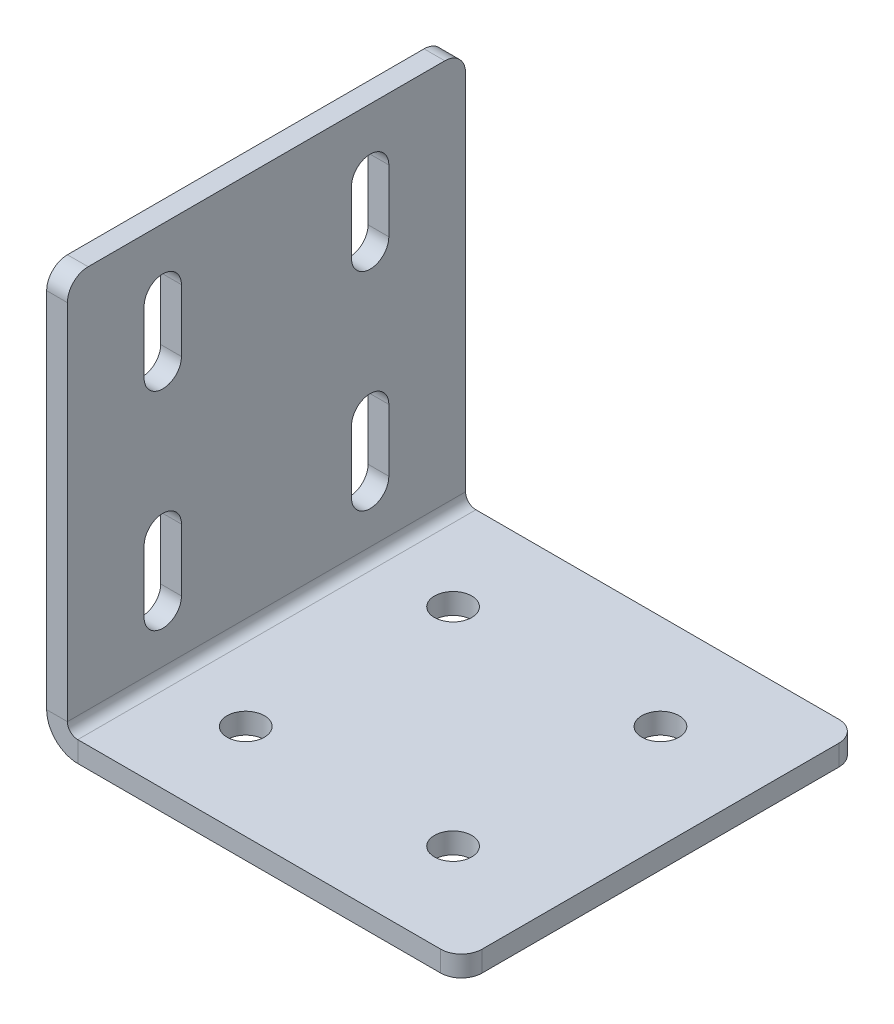
ISO-10303-21;
HEADER;
FILE_DESCRIPTION(('STEP AP214'),'2;1');
FILE_NAME('part.step','',(''),(''),'','','');
FILE_SCHEMA(('AUTOMOTIVE_DESIGN { 1 0 10303 214 1 1 1 1 }'));
ENDSEC;
DATA;
#1=APPLICATION_CONTEXT('core data for automotive mechanical design processes');
#2=APPLICATION_PROTOCOL_DEFINITION('international standard','automotive_design',2000,#1);
#3=PRODUCT_CONTEXT('',#1,'mechanical');
#4=PRODUCT('Part','Part','',(#3));
#5=PRODUCT_RELATED_PRODUCT_CATEGORY('part','',(#4));
#6=PRODUCT_DEFINITION_FORMATION('','',#4);
#7=PRODUCT_DEFINITION_CONTEXT('part definition',#1,'design');
#8=PRODUCT_DEFINITION('design','',#6,#7);
#9=PRODUCT_DEFINITION_SHAPE('','',#8);
#10=(LENGTH_UNIT() NAMED_UNIT(*) SI_UNIT(.MILLI.,.METRE.));
#11=(NAMED_UNIT(*) PLANE_ANGLE_UNIT() SI_UNIT($,.RADIAN.));
#12=(NAMED_UNIT(*) SI_UNIT($,.STERADIAN.) SOLID_ANGLE_UNIT());
#13=UNCERTAINTY_MEASURE_WITH_UNIT(LENGTH_MEASURE(1.E-05),#10,'distance_accuracy_value','');
#14=(GEOMETRIC_REPRESENTATION_CONTEXT(3) GLOBAL_UNCERTAINTY_ASSIGNED_CONTEXT((#13)) GLOBAL_UNIT_ASSIGNED_CONTEXT((#10,
#11,#12)) REPRESENTATION_CONTEXT('',''));
#15=CARTESIAN_POINT('',(0.,0.,0.));
#16=DIRECTION('',(0.,0.,1.));
#17=DIRECTION('',(1.,0.,0.));
#18=AXIS2_PLACEMENT_3D('',#15,#16,#17);
#19=CARTESIAN_POINT('',(0.,70.,-25.));
#20=DIRECTION('',(-1.,0.,0.));
#21=DIRECTION('',(0.,0.,1.));
#22=AXIS2_PLACEMENT_3D('',#19,#20,#21);
#23=CYLINDRICAL_SURFACE('',#22,4.5);
#24=CARTESIAN_POINT('',(4.99999999999999,70.,-25.));
#25=DIRECTION('',(1.,0.,0.));
#26=DIRECTION('',(0.,0.,-1.));
#27=AXIS2_PLACEMENT_3D('',#24,#25,#26);
#28=CIRCLE('',#27,4.5);
#29=CARTESIAN_POINT('',(5.,70.,-20.5));
#30=VERTEX_POINT('',#29);
#31=CARTESIAN_POINT('',(5.,70.,-29.5));
#32=VERTEX_POINT('',#31);
#33=EDGE_CURVE('E500',#30,#32,#28,.T.);
#34=ORIENTED_EDGE('',*,*,#33,.T.);
#35=DIRECTION('',(1.,0.,0.));
#36=VECTOR('',#35,1.);
#37=CARTESIAN_POINT('',(0.,70.,-29.5));
#38=LINE('',#37,#36);
#39=CARTESIAN_POINT('',(0.,70.,-29.5));
#40=VERTEX_POINT('',#39);
#41=EDGE_CURVE('E279',#40,#32,#38,.T.);
#42=ORIENTED_EDGE('',*,*,#41,.F.);
#43=CARTESIAN_POINT('',(0.,70.,-25.));
#44=DIRECTION('',(1.,0.,0.));
#45=DIRECTION('',(0.,0.,-1.));
#46=AXIS2_PLACEMENT_3D('',#43,#44,#45);
#47=CIRCLE('',#46,4.5);
#48=CARTESIAN_POINT('',(0.,70.,-20.5));
#49=VERTEX_POINT('',#48);
#50=EDGE_CURVE('E389',#49,#40,#47,.T.);
#51=ORIENTED_EDGE('',*,*,#50,.F.);
#52=DIRECTION('',(1.,0.,0.));
#53=VECTOR('',#52,1.);
#54=CARTESIAN_POINT('',(0.,70.,-20.5));
#55=LINE('',#54,#53);
#56=EDGE_CURVE('E246',#49,#30,#55,.T.);
#57=ORIENTED_EDGE('',*,*,#56,.T.);
#58=EDGE_LOOP('',(#34,#42,#51,#57));
#59=FACE_BOUND('',#58,.T.);
#60=ADVANCED_FACE('F49',(#59),#23,.F.);
#61=CARTESIAN_POINT('',(0.,20.,25.));
#62=DIRECTION('',(-1.,0.,0.));
#63=DIRECTION('',(0.,0.,1.));
#64=AXIS2_PLACEMENT_3D('',#61,#62,#63);
#65=CYLINDRICAL_SURFACE('',#64,4.5);
#66=CARTESIAN_POINT('',(5.,20.,25.));
#67=DIRECTION('',(1.,0.,0.));
#68=DIRECTION('',(0.,0.,-1.));
#69=AXIS2_PLACEMENT_3D('',#66,#67,#68);
#70=CIRCLE('',#69,4.5);
#71=CARTESIAN_POINT('',(5.,20.,29.5));
#72=VERTEX_POINT('',#71);
#73=CARTESIAN_POINT('',(5.,20.,20.5));
#74=VERTEX_POINT('',#73);
#75=EDGE_CURVE('E517',#72,#74,#70,.T.);
#76=ORIENTED_EDGE('',*,*,#75,.T.);
#77=DIRECTION('',(1.,0.,0.));
#78=VECTOR('',#77,1.);
#79=CARTESIAN_POINT('',(0.,20.,20.5));
#80=LINE('',#79,#78);
#81=CARTESIAN_POINT('',(0.,20.,20.5));
#82=VERTEX_POINT('',#81);
#83=EDGE_CURVE('E379',#82,#74,#80,.T.);
#84=ORIENTED_EDGE('',*,*,#83,.F.);
#85=CARTESIAN_POINT('',(0.,20.,25.));
#86=DIRECTION('',(1.,0.,0.));
#87=DIRECTION('',(0.,0.,-1.));
#88=AXIS2_PLACEMENT_3D('',#85,#86,#87);
#89=CIRCLE('',#88,4.5);
#90=CARTESIAN_POINT('',(0.,20.,29.5));
#91=VERTEX_POINT('',#90);
#92=EDGE_CURVE('E392',#91,#82,#89,.T.);
#93=ORIENTED_EDGE('',*,*,#92,.F.);
#94=DIRECTION('',(1.,0.,0.));
#95=VECTOR('',#94,1.);
#96=CARTESIAN_POINT('',(0.,20.,29.5));
#97=LINE('',#96,#95);
#98=EDGE_CURVE('E382',#91,#72,#97,.T.);
#99=ORIENTED_EDGE('',*,*,#98,.T.);
#100=EDGE_LOOP('',(#76,#84,#93,#99));
#101=FACE_BOUND('',#100,.T.);
#102=ADVANCED_FACE('F664',(#101),#65,.F.);
#103=CARTESIAN_POINT('',(0.,70.,25.));
#104=DIRECTION('',(-1.,0.,0.));
#105=DIRECTION('',(0.,0.,1.));
#106=AXIS2_PLACEMENT_3D('',#103,#104,#105);
#107=CYLINDRICAL_SURFACE('',#106,4.5);
#108=CARTESIAN_POINT('',(4.99999999999999,70.,25.));
#109=DIRECTION('',(1.,0.,0.));
#110=DIRECTION('',(0.,0.,-1.));
#111=AXIS2_PLACEMENT_3D('',#108,#109,#110);
#112=CIRCLE('',#111,4.5);
#113=CARTESIAN_POINT('',(5.,70.,29.5));
#114=VERTEX_POINT('',#113);
#115=CARTESIAN_POINT('',(5.,70.,20.5));
#116=VERTEX_POINT('',#115);
#117=EDGE_CURVE('E521',#114,#116,#112,.T.);
#118=ORIENTED_EDGE('',*,*,#117,.T.);
#119=DIRECTION('',(1.,0.,0.));
#120=VECTOR('',#119,1.);
#121=CARTESIAN_POINT('',(0.,70.,20.5));
#122=LINE('',#121,#120);
#123=CARTESIAN_POINT('',(0.,70.,20.5));
#124=VERTEX_POINT('',#123);
#125=EDGE_CURVE('E311',#124,#116,#122,.T.);
#126=ORIENTED_EDGE('',*,*,#125,.F.);
#127=CARTESIAN_POINT('',(0.,70.,25.));
#128=DIRECTION('',(1.,0.,0.));
#129=DIRECTION('',(0.,0.,-1.));
#130=AXIS2_PLACEMENT_3D('',#127,#128,#129);
#131=CIRCLE('',#130,4.5);
#132=CARTESIAN_POINT('',(0.,70.,29.5));
#133=VERTEX_POINT('',#132);
#134=EDGE_CURVE('E397',#133,#124,#131,.T.);
#135=ORIENTED_EDGE('',*,*,#134,.F.);
#136=DIRECTION('',(1.,0.,0.));
#137=VECTOR('',#136,1.);
#138=CARTESIAN_POINT('',(0.,70.,29.5));
#139=LINE('',#138,#137);
#140=EDGE_CURVE('E314',#133,#114,#139,.T.);
#141=ORIENTED_EDGE('',*,*,#140,.T.);
#142=EDGE_LOOP('',(#118,#126,#135,#141));
#143=FACE_BOUND('',#142,.T.);
#144=ADVANCED_FACE('F670',(#143),#107,.F.);
#145=CARTESIAN_POINT('',(0.,20.,-25.));
#146=DIRECTION('',(-1.,0.,0.));
#147=DIRECTION('',(0.,0.,1.));
#148=AXIS2_PLACEMENT_3D('',#145,#146,#147);
#149=CYLINDRICAL_SURFACE('',#148,4.5);
#150=CARTESIAN_POINT('',(5.,20.,-25.));
#151=DIRECTION('',(1.,0.,0.));
#152=DIRECTION('',(0.,0.,-1.));
#153=AXIS2_PLACEMENT_3D('',#150,#151,#152);
#154=CIRCLE('',#153,4.5);
#155=CARTESIAN_POINT('',(5.,20.,-20.5));
#156=VERTEX_POINT('',#155);
#157=CARTESIAN_POINT('',(5.,20.,-29.5));
#158=VERTEX_POINT('',#157);
#159=EDGE_CURVE('E510',#156,#158,#154,.T.);
#160=ORIENTED_EDGE('',*,*,#159,.T.);
#161=DIRECTION('',(1.,0.,0.));
#162=VECTOR('',#161,1.);
#163=CARTESIAN_POINT('',(0.,20.,-29.5));
#164=LINE('',#163,#162);
#165=CARTESIAN_POINT('',(0.,20.,-29.5));
#166=VERTEX_POINT('',#165);
#167=EDGE_CURVE('E344',#166,#158,#164,.T.);
#168=ORIENTED_EDGE('',*,*,#167,.F.);
#169=CARTESIAN_POINT('',(0.,20.,-25.));
#170=DIRECTION('',(1.,0.,0.));
#171=DIRECTION('',(0.,0.,-1.));
#172=AXIS2_PLACEMENT_3D('',#169,#170,#171);
#173=CIRCLE('',#172,4.5);
#174=CARTESIAN_POINT('',(0.,20.,-20.5));
#175=VERTEX_POINT('',#174);
#176=EDGE_CURVE('E401',#175,#166,#173,.T.);
#177=ORIENTED_EDGE('',*,*,#176,.F.);
#178=DIRECTION('',(1.,0.,0.));
#179=VECTOR('',#178,1.);
#180=CARTESIAN_POINT('',(0.,20.,-20.5));
#181=LINE('',#180,#179);
#182=EDGE_CURVE('E347',#175,#156,#181,.T.);
#183=ORIENTED_EDGE('',*,*,#182,.T.);
#184=EDGE_LOOP('',(#160,#168,#177,#183));
#185=FACE_BOUND('',#184,.T.);
#186=ADVANCED_FACE('F678',(#185),#149,.F.);
#187=CARTESIAN_POINT('',(0.,0.,48.));
#188=DIRECTION('',(0.,0.,-1.));
#189=DIRECTION('',(0.,-1.,0.));
#190=AXIS2_PLACEMENT_3D('',#187,#188,#189);
#191=PLANE('',#190);
#192=DIRECTION('',(0.,1.,0.));
#193=VECTOR('',#192,1.);
#194=CARTESIAN_POINT('',(5.,0.,48.));
#195=LINE('',#194,#193);
#196=CARTESIAN_POINT('',(5.,95.,48.));
#197=VERTEX_POINT('',#196);
#198=CARTESIAN_POINT('',(5.,7.5,48.));
#199=VERTEX_POINT('',#198);
#200=EDGE_CURVE('E507',#197,#199,#195,.F.);
#201=ORIENTED_EDGE('',*,*,#200,.F.);
#202=DIRECTION('',(1.,0.,0.));
#203=VECTOR('',#202,1.);
#204=CARTESIAN_POINT('',(0.,95.,48.));
#205=LINE('',#204,#203);
#206=CARTESIAN_POINT('',(0.,95.,48.));
#207=VERTEX_POINT('',#206);
#208=EDGE_CURVE('E11',#197,#207,#205,.F.);
#209=ORIENTED_EDGE('',*,*,#208,.T.);
#210=DIRECTION('',(0.,-1.,0.));
#211=VECTOR('',#210,1.);
#212=CARTESIAN_POINT('',(0.,0.,48.));
#213=LINE('',#212,#211);
#214=CARTESIAN_POINT('',(0.,7.5,48.));
#215=VERTEX_POINT('',#214);
#216=EDGE_CURVE('E405',#207,#215,#213,.T.);
#217=ORIENTED_EDGE('',*,*,#216,.T.);
#218=DIRECTION('',(-1.,0.,0.));
#219=VECTOR('',#218,1.);
#220=CARTESIAN_POINT('',(0.,7.5,48.));
#221=LINE('',#220,#219);
#222=EDGE_CURVE('E535',#199,#215,#221,.T.);
#223=ORIENTED_EDGE('',*,*,#222,.F.);
#224=EDGE_LOOP('',(#201,#209,#217,#223));
#225=FACE_BOUND('',#224,.T.);
#226=ADVANCED_FACE('F621',(#225),#191,.F.);
#227=CARTESIAN_POINT('',(0.,100.,-48.));
#228=DIRECTION('',(0.,-1.,0.));
#229=DIRECTION('',(0.,0.,1.));
#230=AXIS2_PLACEMENT_3D('',#227,#228,#229);
#231=PLANE('',#230);
#232=DIRECTION('',(0.,0.,1.));
#233=VECTOR('',#232,1.);
#234=CARTESIAN_POINT('',(5.,100.,-48.));
#235=LINE('',#234,#233);
#236=CARTESIAN_POINT('',(5.,100.,-43.));
#237=VERTEX_POINT('',#236);
#238=CARTESIAN_POINT('',(5.,100.,43.));
#239=VERTEX_POINT('',#238);
#240=EDGE_CURVE('E503',#237,#239,#235,.T.);
#241=ORIENTED_EDGE('',*,*,#240,.F.);
#242=DIRECTION('',(-1.,0.,0.));
#243=VECTOR('',#242,1.);
#244=CARTESIAN_POINT('',(0.,100.,-43.));
#245=LINE('',#244,#243);
#246=CARTESIAN_POINT('',(0.,100.,-43.));
#247=VERTEX_POINT('',#246);
#248=EDGE_CURVE('E570',#237,#247,#245,.T.);
#249=ORIENTED_EDGE('',*,*,#248,.T.);
#250=DIRECTION('',(0.,0.,1.));
#251=VECTOR('',#250,1.);
#252=CARTESIAN_POINT('',(0.,100.,-48.));
#253=LINE('',#252,#251);
#254=CARTESIAN_POINT('',(0.,100.,43.));
#255=VERTEX_POINT('',#254);
#256=EDGE_CURVE('E408',#247,#255,#253,.T.);
#257=ORIENTED_EDGE('',*,*,#256,.T.);
#258=DIRECTION('',(1.,0.,0.));
#259=VECTOR('',#258,1.);
#260=CARTESIAN_POINT('',(0.,100.,43.));
#261=LINE('',#260,#259);
#262=EDGE_CURVE('E567',#255,#239,#261,.T.);
#263=ORIENTED_EDGE('',*,*,#262,.T.);
#264=EDGE_LOOP('',(#241,#249,#257,#263));
#265=FACE_BOUND('',#264,.T.);
#266=ADVANCED_FACE('F599',(#265),#231,.F.);
#267=CARTESIAN_POINT('',(0.,0.,-48.));
#268=DIRECTION('',(0.,0.,-1.));
#269=DIRECTION('',(0.,-1.,0.));
#270=AXIS2_PLACEMENT_3D('',#267,#268,#269);
#271=PLANE('',#270);
#272=DIRECTION('',(0.,-1.,0.));
#273=VECTOR('',#272,1.);
#274=CARTESIAN_POINT('',(0.,0.,-48.));
#275=LINE('',#274,#273);
#276=CARTESIAN_POINT('',(0.,95.,-48.));
#277=VERTEX_POINT('',#276);
#278=CARTESIAN_POINT('',(0.,7.5,-48.));
#279=VERTEX_POINT('',#278);
#280=EDGE_CURVE('E412',#277,#279,#275,.T.);
#281=ORIENTED_EDGE('',*,*,#280,.F.);
#282=DIRECTION('',(1.,0.,0.));
#283=VECTOR('',#282,1.);
#284=CARTESIAN_POINT('',(0.,95.,-48.));
#285=LINE('',#284,#283);
#286=CARTESIAN_POINT('',(5.,95.,-48.));
#287=VERTEX_POINT('',#286);
#288=EDGE_CURVE('E580',#277,#287,#285,.T.);
#289=ORIENTED_EDGE('',*,*,#288,.T.);
#290=DIRECTION('',(0.,1.,0.));
#291=VECTOR('',#290,1.);
#292=CARTESIAN_POINT('',(5.,0.,-48.));
#293=LINE('',#292,#291);
#294=CARTESIAN_POINT('',(5.,7.5,-48.));
#295=VERTEX_POINT('',#294);
#296=EDGE_CURVE('E473',#287,#295,#293,.F.);
#297=ORIENTED_EDGE('',*,*,#296,.T.);
#298=DIRECTION('',(-1.,0.,0.));
#299=VECTOR('',#298,1.);
#300=CARTESIAN_POINT('',(0.,7.5,-48.));
#301=LINE('',#300,#299);
#302=EDGE_CURVE('E531',#295,#279,#301,.T.);
#303=ORIENTED_EDGE('',*,*,#302,.T.);
#304=EDGE_LOOP('',(#281,#289,#297,#303));
#305=FACE_BOUND('',#304,.T.);
#306=ADVANCED_FACE('F606',(#305),#271,.T.);
#307=CARTESIAN_POINT('',(7.5,7.5,-48.));
#308=DIRECTION('',(0.,0.,1.));
#309=DIRECTION('',(1.,0.,0.));
#310=AXIS2_PLACEMENT_3D('',#307,#308,#309);
#311=PLANE('',#310);
#312=ORIENTED_EDGE('',*,*,#302,.F.);
#313=CARTESIAN_POINT('',(7.5,7.5,-48.));
#314=DIRECTION('',(0.,0.,1.));
#315=DIRECTION('',(1.,0.,0.));
#316=AXIS2_PLACEMENT_3D('',#313,#314,#315);
#317=CIRCLE('',#316,2.5);
#318=CARTESIAN_POINT('',(7.5,5.,-48.));
#319=VERTEX_POINT('',#318);
#320=EDGE_CURVE('E496',#295,#319,#317,.T.);
#321=ORIENTED_EDGE('',*,*,#320,.T.);
#322=DIRECTION('',(0.,-1.,0.));
#323=VECTOR('',#322,1.);
#324=CARTESIAN_POINT('',(7.50000000000001,0.,-48.));
#325=LINE('',#324,#323);
#326=CARTESIAN_POINT('',(7.50000000000001,0.,-48.));
#327=VERTEX_POINT('',#326);
#328=EDGE_CURVE('E528',#319,#327,#325,.T.);
#329=ORIENTED_EDGE('',*,*,#328,.T.);
#330=CARTESIAN_POINT('',(7.5,7.5,-48.));
#331=DIRECTION('',(0.,0.,-1.));
#332=DIRECTION('',(-1.,0.,0.));
#333=AXIS2_PLACEMENT_3D('',#330,#331,#332);
#334=CIRCLE('',#333,7.5);
#335=EDGE_CURVE('E393',#279,#327,#334,.F.);
#336=ORIENTED_EDGE('',*,*,#335,.F.);
#337=EDGE_LOOP('',(#312,#321,#329,#336));
#338=FACE_BOUND('',#337,.T.);
#339=ADVANCED_FACE('F611',(#338),#311,.F.);
#340=CARTESIAN_POINT('',(100.,0.,-48.));
#341=DIRECTION('',(0.,0.,-1.));
#342=DIRECTION('',(1.,0.,0.));
#343=AXIS2_PLACEMENT_3D('',#340,#341,#342);
#344=PLANE('',#343);
#345=DIRECTION('',(1.,0.,0.));
#346=VECTOR('',#345,1.);
#347=CARTESIAN_POINT('',(100.,5.,-48.));
#348=LINE('',#347,#346);
#349=CARTESIAN_POINT('',(95.,5.,-48.));
#350=VERTEX_POINT('',#349);
#351=EDGE_CURVE('E467',#319,#350,#348,.T.);
#352=ORIENTED_EDGE('',*,*,#351,.T.);
#353=DIRECTION('',(0.,-1.,0.));
#354=VECTOR('',#353,1.);
#355=CARTESIAN_POINT('',(95.,0.,-48.));
#356=LINE('',#355,#354);
#357=CARTESIAN_POINT('',(95.,0.,-48.));
#358=VERTEX_POINT('',#357);
#359=EDGE_CURVE('E539',#350,#358,#356,.T.);
#360=ORIENTED_EDGE('',*,*,#359,.T.);
#361=DIRECTION('',(1.,0.,0.));
#362=VECTOR('',#361,1.);
#363=CARTESIAN_POINT('',(100.,0.,-48.));
#364=LINE('',#363,#362);
#365=EDGE_CURVE('E439',#327,#358,#364,.T.);
#366=ORIENTED_EDGE('',*,*,#365,.F.);
#367=ORIENTED_EDGE('',*,*,#328,.F.);
#368=EDGE_LOOP('',(#352,#360,#366,#367));
#369=FACE_BOUND('',#368,.T.);
#370=ADVANCED_FACE('F654',(#369),#344,.T.);
#371=CARTESIAN_POINT('',(100.,0.,-48.));
#372=DIRECTION('',(1.,0.,0.));
#373=DIRECTION('',(0.,0.,1.));
#374=AXIS2_PLACEMENT_3D('',#371,#372,#373);
#375=PLANE('',#374);
#376=DIRECTION('',(0.,0.,1.));
#377=VECTOR('',#376,1.);
#378=CARTESIAN_POINT('',(100.,0.,-48.));
#379=LINE('',#378,#377);
#380=CARTESIAN_POINT('',(100.,0.,-43.));
#381=VERTEX_POINT('',#380);
#382=CARTESIAN_POINT('',(100.,0.,43.));
#383=VERTEX_POINT('',#382);
#384=EDGE_CURVE('E431',#381,#383,#379,.T.);
#385=ORIENTED_EDGE('',*,*,#384,.F.);
#386=DIRECTION('',(0.,-1.,0.));
#387=VECTOR('',#386,1.);
#388=CARTESIAN_POINT('',(100.,0.,-43.));
#389=LINE('',#388,#387);
#390=CARTESIAN_POINT('',(100.,5.,-43.));
#391=VERTEX_POINT('',#390);
#392=EDGE_CURVE('E555',#381,#391,#389,.F.);
#393=ORIENTED_EDGE('',*,*,#392,.T.);
#394=DIRECTION('',(0.,0.,1.));
#395=VECTOR('',#394,1.);
#396=CARTESIAN_POINT('',(100.,5.,-48.));
#397=LINE('',#396,#395);
#398=CARTESIAN_POINT('',(100.,5.,43.));
#399=VERTEX_POINT('',#398);
#400=EDGE_CURVE('E485',#391,#399,#397,.T.);
#401=ORIENTED_EDGE('',*,*,#400,.T.);
#402=DIRECTION('',(0.,1.,0.));
#403=VECTOR('',#402,1.);
#404=CARTESIAN_POINT('',(100.,0.,43.));
#405=LINE('',#404,#403);
#406=EDGE_CURVE('E551',#399,#383,#405,.F.);
#407=ORIENTED_EDGE('',*,*,#406,.T.);
#408=EDGE_LOOP('',(#385,#393,#401,#407));
#409=FACE_BOUND('',#408,.T.);
#410=ADVANCED_FACE('F645',(#409),#375,.T.);
#411=CARTESIAN_POINT('',(100.,0.,48.));
#412=DIRECTION('',(0.,0.,-1.));
#413=DIRECTION('',(1.,0.,0.));
#414=AXIS2_PLACEMENT_3D('',#411,#412,#413);
#415=PLANE('',#414);
#416=DIRECTION('',(1.,0.,0.));
#417=VECTOR('',#416,1.);
#418=CARTESIAN_POINT('',(100.,0.,48.));
#419=LINE('',#418,#417);
#420=CARTESIAN_POINT('',(7.50000000000001,0.,48.));
#421=VERTEX_POINT('',#420);
#422=CARTESIAN_POINT('',(95.,0.,48.));
#423=VERTEX_POINT('',#422);
#424=EDGE_CURVE('E435',#421,#423,#419,.T.);
#425=ORIENTED_EDGE('',*,*,#424,.T.);
#426=DIRECTION('',(0.,-1.,0.));
#427=VECTOR('',#426,1.);
#428=CARTESIAN_POINT('',(95.,0.,48.));
#429=LINE('',#428,#427);
#430=CARTESIAN_POINT('',(95.,5.,48.));
#431=VERTEX_POINT('',#430);
#432=EDGE_CURVE('E564',#423,#431,#429,.F.);
#433=ORIENTED_EDGE('',*,*,#432,.T.);
#434=DIRECTION('',(1.,0.,0.));
#435=VECTOR('',#434,1.);
#436=CARTESIAN_POINT('',(100.,5.,48.));
#437=LINE('',#436,#435);
#438=CARTESIAN_POINT('',(7.50000000000001,5.,48.));
#439=VERTEX_POINT('',#438);
#440=EDGE_CURVE('E486',#439,#431,#437,.T.);
#441=ORIENTED_EDGE('',*,*,#440,.F.);
#442=DIRECTION('',(0.,-1.,0.));
#443=VECTOR('',#442,1.);
#444=CARTESIAN_POINT('',(7.50000000000001,0.,48.));
#445=LINE('',#444,#443);
#446=EDGE_CURVE('E451',#439,#421,#445,.T.);
#447=ORIENTED_EDGE('',*,*,#446,.T.);
#448=EDGE_LOOP('',(#425,#433,#441,#447));
#449=FACE_BOUND('',#448,.T.);
#450=ADVANCED_FACE('F632',(#449),#415,.F.);
#451=CARTESIAN_POINT('',(25.,0.,-25.));
#452=DIRECTION('',(0.,-1.,0.));
#453=DIRECTION('',(1.,0.,0.));
#454=AXIS2_PLACEMENT_3D('',#451,#452,#453);
#455=CYLINDRICAL_SURFACE('',#454,4.49999999999999);
#456=CARTESIAN_POINT('',(25.,0.,-25.));
#457=DIRECTION('',(0.,-1.,0.));
#458=DIRECTION('',(0.,0.,-1.));
#459=AXIS2_PLACEMENT_3D('',#456,#457,#458);
#460=CIRCLE('',#459,4.49999999999999);
#461=CARTESIAN_POINT('',(25.,0.,-29.5));
#462=VERTEX_POINT('',#461);
#463=EDGE_CURVE('E415',#462,#462,#460,.T.);
#464=ORIENTED_EDGE('',*,*,#463,.T.);
#465=EDGE_LOOP('',(#464));
#466=FACE_BOUND('',#465,.T.);
#467=CARTESIAN_POINT('',(25.,5.,-25.));
#468=DIRECTION('',(0.,-1.,0.));
#469=DIRECTION('',(0.,0.,-1.));
#470=AXIS2_PLACEMENT_3D('',#467,#468,#469);
#471=CIRCLE('',#470,4.49999999999999);
#472=CARTESIAN_POINT('',(25.,5.,-29.5));
#473=VERTEX_POINT('',#472);
#474=EDGE_CURVE('E468',#473,#473,#471,.T.);
#475=ORIENTED_EDGE('',*,*,#474,.F.);
#476=EDGE_LOOP('',(#475));
#477=FACE_BOUND('',#476,.T.);
#478=ADVANCED_FACE('F722',(#466,#477),#455,.F.);
#479=CARTESIAN_POINT('',(75.,0.,25.));
#480=DIRECTION('',(0.,-1.,0.));
#481=DIRECTION('',(1.,0.,0.));
#482=AXIS2_PLACEMENT_3D('',#479,#480,#481);
#483=CYLINDRICAL_SURFACE('',#482,4.49999999999999);
#484=CARTESIAN_POINT('',(75.,0.,25.));
#485=DIRECTION('',(0.,-1.,0.));
#486=DIRECTION('',(0.,0.,-1.));
#487=AXIS2_PLACEMENT_3D('',#484,#485,#486);
#488=CIRCLE('',#487,4.49999999999999);
#489=CARTESIAN_POINT('',(75.,0.,20.5));
#490=VERTEX_POINT('',#489);
#491=EDGE_CURVE('E419',#490,#490,#488,.T.);
#492=ORIENTED_EDGE('',*,*,#491,.T.);
#493=EDGE_LOOP('',(#492));
#494=FACE_BOUND('',#493,.T.);
#495=CARTESIAN_POINT('',(75.,5.,25.));
#496=DIRECTION('',(0.,-1.,0.));
#497=DIRECTION('',(0.,0.,-1.));
#498=AXIS2_PLACEMENT_3D('',#495,#496,#497);
#499=CIRCLE('',#498,4.49999999999999);
#500=CARTESIAN_POINT('',(75.,5.,20.5));
#501=VERTEX_POINT('',#500);
#502=EDGE_CURVE('E472',#501,#501,#499,.T.);
#503=ORIENTED_EDGE('',*,*,#502,.F.);
#504=EDGE_LOOP('',(#503));
#505=FACE_BOUND('',#504,.T.);
#506=ADVANCED_FACE('F725',(#494,#505),#483,.F.);
#507=CARTESIAN_POINT('',(75.,0.,-25.));
#508=DIRECTION('',(0.,-1.,0.));
#509=DIRECTION('',(1.,0.,0.));
#510=AXIS2_PLACEMENT_3D('',#507,#508,#509);
#511=CYLINDRICAL_SURFACE('',#510,4.49999999999999);
#512=CARTESIAN_POINT('',(75.,0.,-25.));
#513=DIRECTION('',(0.,-1.,0.));
#514=DIRECTION('',(0.,0.,-1.));
#515=AXIS2_PLACEMENT_3D('',#512,#513,#514);
#516=CIRCLE('',#515,4.49999999999999);
#517=CARTESIAN_POINT('',(75.,0.,-29.5));
#518=VERTEX_POINT('',#517);
#519=EDGE_CURVE('E423',#518,#518,#516,.T.);
#520=ORIENTED_EDGE('',*,*,#519,.T.);
#521=EDGE_LOOP('',(#520));
#522=FACE_BOUND('',#521,.T.);
#523=CARTESIAN_POINT('',(75.,5.,-25.));
#524=DIRECTION('',(0.,-1.,0.));
#525=DIRECTION('',(0.,0.,-1.));
#526=AXIS2_PLACEMENT_3D('',#523,#524,#525);
#527=CIRCLE('',#526,4.49999999999999);
#528=CARTESIAN_POINT('',(75.,5.,-29.5));
#529=VERTEX_POINT('',#528);
#530=EDGE_CURVE('E477',#529,#529,#527,.T.);
#531=ORIENTED_EDGE('',*,*,#530,.F.);
#532=EDGE_LOOP('',(#531));
#533=FACE_BOUND('',#532,.T.);
#534=ADVANCED_FACE('F729',(#522,#533),#511,.F.);
#535=CARTESIAN_POINT('',(25.,0.,25.));
#536=DIRECTION('',(0.,-1.,0.));
#537=DIRECTION('',(1.,0.,0.));
#538=AXIS2_PLACEMENT_3D('',#535,#536,#537);
#539=CYLINDRICAL_SURFACE('',#538,4.49999999999999);
#540=CARTESIAN_POINT('',(25.,0.,25.));
#541=DIRECTION('',(0.,-1.,0.));
#542=DIRECTION('',(0.,0.,-1.));
#543=AXIS2_PLACEMENT_3D('',#540,#541,#542);
#544=CIRCLE('',#543,4.49999999999999);
#545=CARTESIAN_POINT('',(25.,0.,20.5));
#546=VERTEX_POINT('',#545);
#547=EDGE_CURVE('E427',#546,#546,#544,.T.);
#548=ORIENTED_EDGE('',*,*,#547,.T.);
#549=EDGE_LOOP('',(#548));
#550=FACE_BOUND('',#549,.T.);
#551=CARTESIAN_POINT('',(25.,5.,25.));
#552=DIRECTION('',(0.,-1.,0.));
#553=DIRECTION('',(0.,0.,-1.));
#554=AXIS2_PLACEMENT_3D('',#551,#552,#553);
#555=CIRCLE('',#554,4.49999999999999);
#556=CARTESIAN_POINT('',(25.,5.,20.5));
#557=VERTEX_POINT('',#556);
#558=EDGE_CURVE('E481',#557,#557,#555,.T.);
#559=ORIENTED_EDGE('',*,*,#558,.F.);
#560=EDGE_LOOP('',(#559));
#561=FACE_BOUND('',#560,.T.);
#562=ADVANCED_FACE('F733',(#550,#561),#539,.F.);
#563=CARTESIAN_POINT('',(7.5,7.5,48.));
#564=DIRECTION('',(0.,0.,-1.));
#565=DIRECTION('',(-1.,0.,0.));
#566=AXIS2_PLACEMENT_3D('',#563,#564,#565);
#567=PLANE('',#566);
#568=CARTESIAN_POINT('',(7.5,7.5,48.));
#569=DIRECTION('',(0.,0.,1.));
#570=DIRECTION('',(1.,0.,0.));
#571=AXIS2_PLACEMENT_3D('',#568,#569,#570);
#572=CIRCLE('',#571,2.5);
#573=EDGE_CURVE('E378',#439,#199,#572,.F.);
#574=ORIENTED_EDGE('',*,*,#573,.T.);
#575=ORIENTED_EDGE('',*,*,#222,.T.);
#576=CARTESIAN_POINT('',(7.5,7.5,48.));
#577=DIRECTION('',(0.,0.,1.));
#578=DIRECTION('',(1.,0.,0.));
#579=AXIS2_PLACEMENT_3D('',#576,#577,#578);
#580=CIRCLE('',#579,7.5);
#581=EDGE_CURVE('E452',#421,#215,#580,.F.);
#582=ORIENTED_EDGE('',*,*,#581,.F.);
#583=ORIENTED_EDGE('',*,*,#446,.F.);
#584=EDGE_LOOP('',(#574,#575,#582,#583));
#585=FACE_BOUND('',#584,.T.);
#586=ADVANCED_FACE('F624',(#585),#567,.F.);
#587=CARTESIAN_POINT('',(100.,0.,-48.));
#588=DIRECTION('',(0.,-1.,0.));
#589=DIRECTION('',(1.,0.,0.));
#590=AXIS2_PLACEMENT_3D('',#587,#588,#589);
#591=PLANE('',#590);
#592=ORIENTED_EDGE('',*,*,#463,.F.);
#593=EDGE_LOOP('',(#592));
#594=FACE_BOUND('',#593,.T.);
#595=ORIENTED_EDGE('',*,*,#491,.F.);
#596=EDGE_LOOP('',(#595));
#597=FACE_BOUND('',#596,.T.);
#598=ORIENTED_EDGE('',*,*,#519,.F.);
#599=EDGE_LOOP('',(#598));
#600=FACE_BOUND('',#599,.T.);
#601=ORIENTED_EDGE('',*,*,#547,.F.);
#602=EDGE_LOOP('',(#601));
#603=FACE_BOUND('',#602,.T.);
#604=ORIENTED_EDGE('',*,*,#365,.T.);
#605=CARTESIAN_POINT('',(95.,0.,-43.));
#606=DIRECTION('',(0.,-1.,0.));
#607=DIRECTION('',(1.,0.,0.));
#608=AXIS2_PLACEMENT_3D('',#605,#606,#607);
#609=CIRCLE('',#608,5.);
#610=EDGE_CURVE('E548',#358,#381,#609,.T.);
#611=ORIENTED_EDGE('',*,*,#610,.T.);
#612=ORIENTED_EDGE('',*,*,#384,.T.);
#613=CARTESIAN_POINT('',(95.,0.,43.));
#614=DIRECTION('',(0.,-1.,0.));
#615=DIRECTION('',(1.,0.,0.));
#616=AXIS2_PLACEMENT_3D('',#613,#614,#615);
#617=CIRCLE('',#616,5.);
#618=EDGE_CURVE('E545',#383,#423,#617,.T.);
#619=ORIENTED_EDGE('',*,*,#618,.T.);
#620=ORIENTED_EDGE('',*,*,#424,.F.);
#621=DIRECTION('',(0.,0.,1.));
#622=VECTOR('',#621,1.);
#623=CARTESIAN_POINT('',(7.50000000000001,0.,-48.));
#624=LINE('',#623,#622);
#625=EDGE_CURVE('E447',#421,#327,#624,.F.);
#626=ORIENTED_EDGE('',*,*,#625,.T.);
#627=EDGE_LOOP('',(#604,#611,#612,#619,#620,#626));
#628=FACE_BOUND('',#627,.T.);
#629=ADVANCED_FACE('F648',(#594,#597,#600,#603,#628),#591,.T.);
#630=CARTESIAN_POINT('',(0.,0.,-48.));
#631=DIRECTION('',(-1.,0.,0.));
#632=DIRECTION('',(0.,0.,1.));
#633=AXIS2_PLACEMENT_3D('',#630,#631,#632);
#634=PLANE('',#633);
#635=DIRECTION('',(0.,1.,0.));
#636=VECTOR('',#635,1.);
#637=CARTESIAN_POINT('',(0.,85.,20.5));
#638=LINE('',#637,#636);
#639=CARTESIAN_POINT('',(0.,85.,20.5));
#640=VERTEX_POINT('',#639);
#641=EDGE_CURVE('E293',#124,#640,#638,.T.);
#642=ORIENTED_EDGE('',*,*,#641,.T.);
#643=CARTESIAN_POINT('',(0.,85.,25.));
#644=DIRECTION('',(1.,0.,0.));
#645=DIRECTION('',(0.,0.,-1.));
#646=AXIS2_PLACEMENT_3D('',#643,#644,#645);
#647=CIRCLE('',#646,4.5);
#648=CARTESIAN_POINT('',(0.,85.,29.5));
#649=VERTEX_POINT('',#648);
#650=EDGE_CURVE('E284',#640,#649,#647,.T.);
#651=ORIENTED_EDGE('',*,*,#650,.T.);
#652=DIRECTION('',(0.,-1.,0.));
#653=VECTOR('',#652,1.);
#654=CARTESIAN_POINT('',(0.,85.,29.5));
#655=LINE('',#654,#653);
#656=EDGE_CURVE('E288',#649,#133,#655,.T.);
#657=ORIENTED_EDGE('',*,*,#656,.T.);
#658=ORIENTED_EDGE('',*,*,#134,.T.);
#659=EDGE_LOOP('',(#642,#651,#657,#658));
#660=FACE_BOUND('',#659,.T.);
#661=DIRECTION('',(0.,1.,0.));
#662=VECTOR('',#661,1.);
#663=CARTESIAN_POINT('',(0.,35.,-29.5));
#664=LINE('',#663,#662);
#665=CARTESIAN_POINT('',(0.,35.,-29.5));
#666=VERTEX_POINT('',#665);
#667=EDGE_CURVE('E329',#166,#666,#664,.T.);
#668=ORIENTED_EDGE('',*,*,#667,.T.);
#669=CARTESIAN_POINT('',(0.,35.,-25.));
#670=DIRECTION('',(1.,0.,0.));
#671=DIRECTION('',(0.,0.,-1.));
#672=AXIS2_PLACEMENT_3D('',#669,#670,#671);
#673=CIRCLE('',#672,4.5);
#674=CARTESIAN_POINT('',(0.,35.,-20.5));
#675=VERTEX_POINT('',#674);
#676=EDGE_CURVE('E320',#666,#675,#673,.T.);
#677=ORIENTED_EDGE('',*,*,#676,.T.);
#678=DIRECTION('',(0.,-1.,0.));
#679=VECTOR('',#678,1.);
#680=CARTESIAN_POINT('',(0.,35.,-20.5));
#681=LINE('',#680,#679);
#682=EDGE_CURVE('E324',#675,#175,#681,.T.);
#683=ORIENTED_EDGE('',*,*,#682,.T.);
#684=ORIENTED_EDGE('',*,*,#176,.T.);
#685=EDGE_LOOP('',(#668,#677,#683,#684));
#686=FACE_BOUND('',#685,.T.);
#687=DIRECTION('',(0.,1.,0.));
#688=VECTOR('',#687,1.);
#689=CARTESIAN_POINT('',(0.,85.,-29.5));
#690=LINE('',#689,#688);
#691=CARTESIAN_POINT('',(0.,85.,-29.5));
#692=VERTEX_POINT('',#691);
#693=EDGE_CURVE('E247',#40,#692,#690,.T.);
#694=ORIENTED_EDGE('',*,*,#693,.T.);
#695=CARTESIAN_POINT('',(0.,85.,-25.));
#696=DIRECTION('',(1.,0.,0.));
#697=DIRECTION('',(0.,0.,-1.));
#698=AXIS2_PLACEMENT_3D('',#695,#696,#697);
#699=CIRCLE('',#698,4.49999999999999);
#700=CARTESIAN_POINT('',(0.,85.,-20.5));
#701=VERTEX_POINT('',#700);
#702=EDGE_CURVE('E239',#692,#701,#699,.T.);
#703=ORIENTED_EDGE('',*,*,#702,.T.);
#704=DIRECTION('',(0.,-1.,0.));
#705=VECTOR('',#704,1.);
#706=CARTESIAN_POINT('',(0.,85.,-20.5));
#707=LINE('',#706,#705);
#708=EDGE_CURVE('E250',#701,#49,#707,.T.);
#709=ORIENTED_EDGE('',*,*,#708,.T.);
#710=ORIENTED_EDGE('',*,*,#50,.T.);
#711=EDGE_LOOP('',(#694,#703,#709,#710));
#712=FACE_BOUND('',#711,.T.);
#713=DIRECTION('',(0.,1.,0.));
#714=VECTOR('',#713,1.);
#715=CARTESIAN_POINT('',(0.,35.,20.5));
#716=LINE('',#715,#714);
#717=CARTESIAN_POINT('',(0.,35.,20.5));
#718=VERTEX_POINT('',#717);
#719=EDGE_CURVE('E362',#82,#718,#716,.T.);
#720=ORIENTED_EDGE('',*,*,#719,.T.);
#721=CARTESIAN_POINT('',(0.,35.,25.));
#722=DIRECTION('',(1.,0.,0.));
#723=DIRECTION('',(0.,0.,-1.));
#724=AXIS2_PLACEMENT_3D('',#721,#722,#723);
#725=CIRCLE('',#724,4.5);
#726=CARTESIAN_POINT('',(0.,35.,29.5));
#727=VERTEX_POINT('',#726);
#728=EDGE_CURVE('E353',#718,#727,#725,.T.);
#729=ORIENTED_EDGE('',*,*,#728,.T.);
#730=DIRECTION('',(0.,-1.,0.));
#731=VECTOR('',#730,1.);
#732=CARTESIAN_POINT('',(0.,35.,29.5));
#733=LINE('',#732,#731);
#734=EDGE_CURVE('E357',#727,#91,#733,.T.);
#735=ORIENTED_EDGE('',*,*,#734,.T.);
#736=ORIENTED_EDGE('',*,*,#92,.T.);
#737=EDGE_LOOP('',(#720,#729,#735,#736));
#738=FACE_BOUND('',#737,.T.);
#739=ORIENTED_EDGE('',*,*,#256,.F.);
#740=CARTESIAN_POINT('',(0.,95.,-43.));
#741=DIRECTION('',(-1.,0.,0.));
#742=DIRECTION('',(0.,0.,1.));
#743=AXIS2_PLACEMENT_3D('',#740,#741,#742);
#744=CIRCLE('',#743,5.);
#745=EDGE_CURVE('E577',#247,#277,#744,.T.);
#746=ORIENTED_EDGE('',*,*,#745,.T.);
#747=ORIENTED_EDGE('',*,*,#280,.T.);
#748=DIRECTION('',(0.,0.,1.));
#749=VECTOR('',#748,1.);
#750=CARTESIAN_POINT('',(0.,7.5,-48.));
#751=LINE('',#750,#749);
#752=EDGE_CURVE('E443',#279,#215,#751,.T.);
#753=ORIENTED_EDGE('',*,*,#752,.T.);
#754=ORIENTED_EDGE('',*,*,#216,.F.);
#755=CARTESIAN_POINT('',(0.,95.,43.));
#756=DIRECTION('',(-1.,0.,0.));
#757=DIRECTION('',(0.,0.,1.));
#758=AXIS2_PLACEMENT_3D('',#755,#756,#757);
#759=CIRCLE('',#758,5.);
#760=EDGE_CURVE('E574',#207,#255,#759,.T.);
#761=ORIENTED_EDGE('',*,*,#760,.T.);
#762=EDGE_LOOP('',(#739,#746,#747,#753,#754,#761));
#763=FACE_BOUND('',#762,.T.);
#764=ADVANCED_FACE('F258',(#660,#686,#712,#738,#763),#634,.T.);
#765=CARTESIAN_POINT('',(7.5,7.5,-48.));
#766=DIRECTION('',(0.,0.,1.));
#767=DIRECTION('',(1.,0.,0.));
#768=AXIS2_PLACEMENT_3D('',#765,#766,#767);
#769=CYLINDRICAL_SURFACE('',#768,7.5);
#770=ORIENTED_EDGE('',*,*,#335,.T.);
#771=ORIENTED_EDGE('',*,*,#625,.F.);
#772=ORIENTED_EDGE('',*,*,#581,.T.);
#773=ORIENTED_EDGE('',*,*,#752,.F.);
#774=EDGE_LOOP('',(#770,#771,#772,#773));
#775=FACE_BOUND('',#774,.T.);
#776=ADVANCED_FACE('F615',(#775),#769,.T.);
#777=CARTESIAN_POINT('',(100.,5.,-48.));
#778=DIRECTION('',(0.,-1.,0.));
#779=DIRECTION('',(1.,0.,0.));
#780=AXIS2_PLACEMENT_3D('',#777,#778,#779);
#781=PLANE('',#780);
#782=ORIENTED_EDGE('',*,*,#474,.T.);
#783=EDGE_LOOP('',(#782));
#784=FACE_BOUND('',#783,.T.);
#785=ORIENTED_EDGE('',*,*,#502,.T.);
#786=EDGE_LOOP('',(#785));
#787=FACE_BOUND('',#786,.T.);
#788=ORIENTED_EDGE('',*,*,#530,.T.);
#789=EDGE_LOOP('',(#788));
#790=FACE_BOUND('',#789,.T.);
#791=ORIENTED_EDGE('',*,*,#558,.T.);
#792=EDGE_LOOP('',(#791));
#793=FACE_BOUND('',#792,.T.);
#794=ORIENTED_EDGE('',*,*,#400,.F.);
#795=CARTESIAN_POINT('',(95.,5.,-43.));
#796=DIRECTION('',(0.,-1.,0.));
#797=DIRECTION('',(1.,0.,0.));
#798=AXIS2_PLACEMENT_3D('',#795,#796,#797);
#799=CIRCLE('',#798,5.);
#800=EDGE_CURVE('E561',#391,#350,#799,.F.);
#801=ORIENTED_EDGE('',*,*,#800,.T.);
#802=ORIENTED_EDGE('',*,*,#351,.F.);
#803=DIRECTION('',(0.,0.,1.));
#804=VECTOR('',#803,1.);
#805=CARTESIAN_POINT('',(7.50000000000001,5.,-48.));
#806=LINE('',#805,#804);
#807=EDGE_CURVE('E456',#439,#319,#806,.F.);
#808=ORIENTED_EDGE('',*,*,#807,.F.);
#809=ORIENTED_EDGE('',*,*,#440,.T.);
#810=CARTESIAN_POINT('',(95.,5.,43.));
#811=DIRECTION('',(0.,-1.,0.));
#812=DIRECTION('',(1.,0.,0.));
#813=AXIS2_PLACEMENT_3D('',#810,#811,#812);
#814=CIRCLE('',#813,5.);
#815=EDGE_CURVE('E558',#431,#399,#814,.F.);
#816=ORIENTED_EDGE('',*,*,#815,.T.);
#817=EDGE_LOOP('',(#794,#801,#802,#808,#809,#816));
#818=FACE_BOUND('',#817,.T.);
#819=ADVANCED_FACE('F638',(#784,#787,#790,#793,#818),#781,.F.);
#820=CARTESIAN_POINT('',(5.,0.,-48.));
#821=DIRECTION('',(-1.,0.,0.));
#822=DIRECTION('',(0.,0.,1.));
#823=AXIS2_PLACEMENT_3D('',#820,#821,#822);
#824=PLANE('',#823);
#825=CARTESIAN_POINT('',(5.,85.,-25.));
#826=DIRECTION('',(1.,0.,0.));
#827=DIRECTION('',(0.,0.,-1.));
#828=AXIS2_PLACEMENT_3D('',#825,#826,#827);
#829=CIRCLE('',#828,4.49999999999999);
#830=CARTESIAN_POINT('',(5.,85.,-29.5));
#831=VERTEX_POINT('',#830);
#832=CARTESIAN_POINT('',(5.,85.,-20.5));
#833=VERTEX_POINT('',#832);
#834=EDGE_CURVE('E242',#831,#833,#829,.T.);
#835=ORIENTED_EDGE('',*,*,#834,.F.);
#836=DIRECTION('',(0.,1.,0.));
#837=VECTOR('',#836,1.);
#838=CARTESIAN_POINT('',(5.,85.,-29.5));
#839=LINE('',#838,#837);
#840=EDGE_CURVE('E261',#32,#831,#839,.T.);
#841=ORIENTED_EDGE('',*,*,#840,.F.);
#842=ORIENTED_EDGE('',*,*,#33,.F.);
#843=DIRECTION('',(0.,-1.,0.));
#844=VECTOR('',#843,1.);
#845=CARTESIAN_POINT('',(5.,85.,-20.5));
#846=LINE('',#845,#844);
#847=EDGE_CURVE('E267',#833,#30,#846,.T.);
#848=ORIENTED_EDGE('',*,*,#847,.F.);
#849=EDGE_LOOP('',(#835,#841,#842,#848));
#850=FACE_BOUND('',#849,.T.);
#851=CARTESIAN_POINT('',(5.,35.,25.));
#852=DIRECTION('',(1.,0.,0.));
#853=DIRECTION('',(0.,0.,-1.));
#854=AXIS2_PLACEMENT_3D('',#851,#852,#853);
#855=CIRCLE('',#854,4.5);
#856=CARTESIAN_POINT('',(5.,35.,20.5));
#857=VERTEX_POINT('',#856);
#858=CARTESIAN_POINT('',(5.,35.,29.5));
#859=VERTEX_POINT('',#858);
#860=EDGE_CURVE('E310',#857,#859,#855,.T.);
#861=ORIENTED_EDGE('',*,*,#860,.F.);
#862=DIRECTION('',(0.,1.,0.));
#863=VECTOR('',#862,1.);
#864=CARTESIAN_POINT('',(5.,35.,20.5));
#865=LINE('',#864,#863);
#866=EDGE_CURVE('E358',#74,#857,#865,.T.);
#867=ORIENTED_EDGE('',*,*,#866,.F.);
#868=ORIENTED_EDGE('',*,*,#75,.F.);
#869=DIRECTION('',(0.,-1.,0.));
#870=VECTOR('',#869,1.);
#871=CARTESIAN_POINT('',(5.,35.,29.5));
#872=LINE('',#871,#870);
#873=EDGE_CURVE('E369',#859,#72,#872,.T.);
#874=ORIENTED_EDGE('',*,*,#873,.F.);
#875=EDGE_LOOP('',(#861,#867,#868,#874));
#876=FACE_BOUND('',#875,.T.);
#877=CARTESIAN_POINT('',(5.,85.,25.));
#878=DIRECTION('',(1.,0.,0.));
#879=DIRECTION('',(0.,0.,-1.));
#880=AXIS2_PLACEMENT_3D('',#877,#878,#879);
#881=CIRCLE('',#880,4.5);
#882=CARTESIAN_POINT('',(5.,85.,20.5));
#883=VERTEX_POINT('',#882);
#884=CARTESIAN_POINT('',(5.,85.,29.5));
#885=VERTEX_POINT('',#884);
#886=EDGE_CURVE('E65',#883,#885,#881,.T.);
#887=ORIENTED_EDGE('',*,*,#886,.F.);
#888=DIRECTION('',(0.,1.,0.));
#889=VECTOR('',#888,1.);
#890=CARTESIAN_POINT('',(5.,85.,20.5));
#891=LINE('',#890,#889);
#892=EDGE_CURVE('E289',#116,#883,#891,.T.);
#893=ORIENTED_EDGE('',*,*,#892,.F.);
#894=ORIENTED_EDGE('',*,*,#117,.F.);
#895=DIRECTION('',(0.,-1.,0.));
#896=VECTOR('',#895,1.);
#897=CARTESIAN_POINT('',(5.,85.,29.5));
#898=LINE('',#897,#896);
#899=EDGE_CURVE('E300',#885,#114,#898,.T.);
#900=ORIENTED_EDGE('',*,*,#899,.F.);
#901=EDGE_LOOP('',(#887,#893,#894,#900));
#902=FACE_BOUND('',#901,.T.);
#903=CARTESIAN_POINT('',(5.,35.,-25.));
#904=DIRECTION('',(1.,0.,0.));
#905=DIRECTION('',(0.,0.,-1.));
#906=AXIS2_PLACEMENT_3D('',#903,#904,#905);
#907=CIRCLE('',#906,4.5);
#908=CARTESIAN_POINT('',(5.,35.,-29.5));
#909=VERTEX_POINT('',#908);
#910=CARTESIAN_POINT('',(5.,35.,-20.5));
#911=VERTEX_POINT('',#910);
#912=EDGE_CURVE('E73',#909,#911,#907,.T.);
#913=ORIENTED_EDGE('',*,*,#912,.F.);
#914=DIRECTION('',(0.,1.,0.));
#915=VECTOR('',#914,1.);
#916=CARTESIAN_POINT('',(5.,35.,-29.5));
#917=LINE('',#916,#915);
#918=EDGE_CURVE('E325',#158,#909,#917,.T.);
#919=ORIENTED_EDGE('',*,*,#918,.F.);
#920=ORIENTED_EDGE('',*,*,#159,.F.);
#921=DIRECTION('',(0.,-1.,0.));
#922=VECTOR('',#921,1.);
#923=CARTESIAN_POINT('',(5.,35.,-20.5));
#924=LINE('',#923,#922);
#925=EDGE_CURVE('E336',#911,#156,#924,.T.);
#926=ORIENTED_EDGE('',*,*,#925,.F.);
#927=EDGE_LOOP('',(#913,#919,#920,#926));
#928=FACE_BOUND('',#927,.T.);
#929=ORIENTED_EDGE('',*,*,#296,.F.);
#930=CARTESIAN_POINT('',(5.,95.,-43.));
#931=DIRECTION('',(-1.,0.,0.));
#932=DIRECTION('',(0.,0.,1.));
#933=AXIS2_PLACEMENT_3D('',#930,#931,#932);
#934=CIRCLE('',#933,5.);
#935=EDGE_CURVE('E58',#287,#237,#934,.F.);
#936=ORIENTED_EDGE('',*,*,#935,.T.);
#937=ORIENTED_EDGE('',*,*,#240,.T.);
#938=CARTESIAN_POINT('',(5.,95.,43.));
#939=DIRECTION('',(-1.,0.,0.));
#940=DIRECTION('',(0.,0.,1.));
#941=AXIS2_PLACEMENT_3D('',#938,#939,#940);
#942=CIRCLE('',#941,5.);
#943=EDGE_CURVE('E583',#239,#197,#942,.F.);
#944=ORIENTED_EDGE('',*,*,#943,.T.);
#945=ORIENTED_EDGE('',*,*,#200,.T.);
#946=DIRECTION('',(0.,0.,1.));
#947=VECTOR('',#946,1.);
#948=CARTESIAN_POINT('',(5.,7.5,-48.));
#949=LINE('',#948,#947);
#950=EDGE_CURVE('E463',#295,#199,#949,.T.);
#951=ORIENTED_EDGE('',*,*,#950,.F.);
#952=EDGE_LOOP('',(#929,#936,#937,#944,#945,#951));
#953=FACE_BOUND('',#952,.T.);
#954=ADVANCED_FACE('F592',(#850,#876,#902,#928,#953),#824,.F.);
#955=CARTESIAN_POINT('',(7.5,7.5,-48.));
#956=DIRECTION('',(0.,0.,1.));
#957=DIRECTION('',(1.,0.,0.));
#958=AXIS2_PLACEMENT_3D('',#955,#956,#957);
#959=CYLINDRICAL_SURFACE('',#958,2.5);
#960=ORIENTED_EDGE('',*,*,#320,.F.);
#961=ORIENTED_EDGE('',*,*,#950,.T.);
#962=ORIENTED_EDGE('',*,*,#573,.F.);
#963=ORIENTED_EDGE('',*,*,#807,.T.);
#964=EDGE_LOOP('',(#960,#961,#962,#963));
#965=FACE_BOUND('',#964,.T.);
#966=ADVANCED_FACE('F630',(#965),#959,.F.);
#967=CARTESIAN_POINT('',(95.,0.,-43.));
#968=DIRECTION('',(0.,-1.,0.));
#969=DIRECTION('',(1.,0.,0.));
#970=AXIS2_PLACEMENT_3D('',#967,#968,#969);
#971=CYLINDRICAL_SURFACE('',#970,5.);
#972=ORIENTED_EDGE('',*,*,#800,.F.);
#973=ORIENTED_EDGE('',*,*,#392,.F.);
#974=ORIENTED_EDGE('',*,*,#610,.F.);
#975=ORIENTED_EDGE('',*,*,#359,.F.);
#976=EDGE_LOOP('',(#972,#973,#974,#975));
#977=FACE_BOUND('',#976,.T.);
#978=ADVANCED_FACE('F652',(#977),#971,.T.);
#979=CARTESIAN_POINT('',(95.,0.,43.));
#980=DIRECTION('',(0.,1.,0.));
#981=DIRECTION('',(-1.,0.,0.));
#982=AXIS2_PLACEMENT_3D('',#979,#980,#981);
#983=CYLINDRICAL_SURFACE('',#982,5.);
#984=ORIENTED_EDGE('',*,*,#815,.F.);
#985=ORIENTED_EDGE('',*,*,#432,.F.);
#986=ORIENTED_EDGE('',*,*,#618,.F.);
#987=ORIENTED_EDGE('',*,*,#406,.F.);
#988=EDGE_LOOP('',(#984,#985,#986,#987));
#989=FACE_BOUND('',#988,.T.);
#990=ADVANCED_FACE('F642',(#989),#983,.T.);
#991=CARTESIAN_POINT('',(0.,95.,-43.));
#992=DIRECTION('',(1.,0.,0.));
#993=DIRECTION('',(0.,0.,-1.));
#994=AXIS2_PLACEMENT_3D('',#991,#992,#993);
#995=CYLINDRICAL_SURFACE('',#994,5.);
#996=ORIENTED_EDGE('',*,*,#935,.F.);
#997=ORIENTED_EDGE('',*,*,#288,.F.);
#998=ORIENTED_EDGE('',*,*,#745,.F.);
#999=ORIENTED_EDGE('',*,*,#248,.F.);
#1000=EDGE_LOOP('',(#996,#997,#998,#999));
#1001=FACE_BOUND('',#1000,.T.);
#1002=ADVANCED_FACE('F602',(#1001),#995,.T.);
#1003=CARTESIAN_POINT('',(0.,95.,43.));
#1004=DIRECTION('',(-1.,0.,0.));
#1005=DIRECTION('',(0.,0.,1.));
#1006=AXIS2_PLACEMENT_3D('',#1003,#1004,#1005);
#1007=CYLINDRICAL_SURFACE('',#1006,5.);
#1008=ORIENTED_EDGE('',*,*,#943,.F.);
#1009=ORIENTED_EDGE('',*,*,#262,.F.);
#1010=ORIENTED_EDGE('',*,*,#760,.F.);
#1011=ORIENTED_EDGE('',*,*,#208,.F.);
#1012=EDGE_LOOP('',(#1008,#1009,#1010,#1011));
#1013=FACE_BOUND('',#1012,.T.);
#1014=ADVANCED_FACE('F51',(#1013),#1007,.T.);
#1015=CARTESIAN_POINT('',(0.,35.,25.));
#1016=DIRECTION('',(1.,0.,0.));
#1017=DIRECTION('',(0.,0.,-1.));
#1018=AXIS2_PLACEMENT_3D('',#1015,#1016,#1017);
#1019=CYLINDRICAL_SURFACE('',#1018,4.5);
#1020=ORIENTED_EDGE('',*,*,#860,.T.);
#1021=DIRECTION('',(1.,0.,0.));
#1022=VECTOR('',#1021,1.);
#1023=CARTESIAN_POINT('',(0.,35.,29.5));
#1024=LINE('',#1023,#1022);
#1025=EDGE_CURVE('E366',#727,#859,#1024,.T.);
#1026=ORIENTED_EDGE('',*,*,#1025,.F.);
#1027=ORIENTED_EDGE('',*,*,#728,.F.);
#1028=DIRECTION('',(1.,0.,0.));
#1029=VECTOR('',#1028,1.);
#1030=CARTESIAN_POINT('',(0.,35.,20.5));
#1031=LINE('',#1030,#1029);
#1032=EDGE_CURVE('E375',#718,#857,#1031,.T.);
#1033=ORIENTED_EDGE('',*,*,#1032,.T.);
#1034=EDGE_LOOP('',(#1020,#1026,#1027,#1033));
#1035=FACE_BOUND('',#1034,.T.);
#1036=ADVANCED_FACE('F690',(#1035),#1019,.F.);
#1037=CARTESIAN_POINT('',(0.,35.,20.5));
#1038=DIRECTION('',(0.,0.,-1.));
#1039=DIRECTION('',(-1.,0.,0.));
#1040=AXIS2_PLACEMENT_3D('',#1037,#1038,#1039);
#1041=PLANE('',#1040);
#1042=ORIENTED_EDGE('',*,*,#866,.T.);
#1043=ORIENTED_EDGE('',*,*,#1032,.F.);
#1044=ORIENTED_EDGE('',*,*,#719,.F.);
#1045=ORIENTED_EDGE('',*,*,#83,.T.);
#1046=EDGE_LOOP('',(#1042,#1043,#1044,#1045));
#1047=FACE_BOUND('',#1046,.T.);
#1048=ADVANCED_FACE('F695',(#1047),#1041,.F.);
#1049=CARTESIAN_POINT('',(0.,35.,29.5));
#1050=DIRECTION('',(0.,0.,1.));
#1051=DIRECTION('',(0.,-1.,0.));
#1052=AXIS2_PLACEMENT_3D('',#1049,#1050,#1051);
#1053=PLANE('',#1052);
#1054=ORIENTED_EDGE('',*,*,#873,.T.);
#1055=ORIENTED_EDGE('',*,*,#98,.F.);
#1056=ORIENTED_EDGE('',*,*,#734,.F.);
#1057=ORIENTED_EDGE('',*,*,#1025,.T.);
#1058=EDGE_LOOP('',(#1054,#1055,#1056,#1057));
#1059=FACE_BOUND('',#1058,.T.);
#1060=ADVANCED_FACE('F701',(#1059),#1053,.F.);
#1061=CARTESIAN_POINT('',(0.,85.,-25.));
#1062=DIRECTION('',(1.,0.,0.));
#1063=DIRECTION('',(0.,0.,-1.));
#1064=AXIS2_PLACEMENT_3D('',#1061,#1062,#1063);
#1065=CYLINDRICAL_SURFACE('',#1064,4.49999999999999);
#1066=ORIENTED_EDGE('',*,*,#834,.T.);
#1067=DIRECTION('',(1.,0.,0.));
#1068=VECTOR('',#1067,1.);
#1069=CARTESIAN_POINT('',(0.,85.,-20.5));
#1070=LINE('',#1069,#1068);
#1071=EDGE_CURVE('E235',#701,#833,#1070,.T.);
#1072=ORIENTED_EDGE('',*,*,#1071,.F.);
#1073=ORIENTED_EDGE('',*,*,#702,.F.);
#1074=DIRECTION('',(1.,0.,0.));
#1075=VECTOR('',#1074,1.);
#1076=CARTESIAN_POINT('',(0.,85.,-29.5));
#1077=LINE('',#1076,#1075);
#1078=EDGE_CURVE('E276',#692,#831,#1077,.T.);
#1079=ORIENTED_EDGE('',*,*,#1078,.T.);
#1080=EDGE_LOOP('',(#1066,#1072,#1073,#1079));
#1081=FACE_BOUND('',#1080,.T.);
#1082=ADVANCED_FACE('F237',(#1081),#1065,.F.);
#1083=CARTESIAN_POINT('',(0.,85.,-29.5));
#1084=DIRECTION('',(0.,0.,-1.));
#1085=DIRECTION('',(0.,1.,0.));
#1086=AXIS2_PLACEMENT_3D('',#1083,#1084,#1085);
#1087=PLANE('',#1086);
#1088=ORIENTED_EDGE('',*,*,#840,.T.);
#1089=ORIENTED_EDGE('',*,*,#1078,.F.);
#1090=ORIENTED_EDGE('',*,*,#693,.F.);
#1091=ORIENTED_EDGE('',*,*,#41,.T.);
#1092=EDGE_LOOP('',(#1088,#1089,#1090,#1091));
#1093=FACE_BOUND('',#1092,.T.);
#1094=ADVANCED_FACE('F825',(#1093),#1087,.F.);
#1095=CARTESIAN_POINT('',(0.,85.,-20.5));
#1096=DIRECTION('',(0.,0.,1.));
#1097=DIRECTION('',(0.,-1.,0.));
#1098=AXIS2_PLACEMENT_3D('',#1095,#1096,#1097);
#1099=PLANE('',#1098);
#1100=ORIENTED_EDGE('',*,*,#847,.T.);
#1101=ORIENTED_EDGE('',*,*,#56,.F.);
#1102=ORIENTED_EDGE('',*,*,#708,.F.);
#1103=ORIENTED_EDGE('',*,*,#1071,.T.);
#1104=EDGE_LOOP('',(#1100,#1101,#1102,#1103));
#1105=FACE_BOUND('',#1104,.T.);
#1106=ADVANCED_FACE('F251',(#1105),#1099,.F.);
#1107=CARTESIAN_POINT('',(0.,35.,-25.));
#1108=DIRECTION('',(1.,0.,0.));
#1109=DIRECTION('',(0.,0.,-1.));
#1110=AXIS2_PLACEMENT_3D('',#1107,#1108,#1109);
#1111=CYLINDRICAL_SURFACE('',#1110,4.5);
#1112=ORIENTED_EDGE('',*,*,#912,.T.);
#1113=DIRECTION('',(1.,0.,0.));
#1114=VECTOR('',#1113,1.);
#1115=CARTESIAN_POINT('',(0.,35.,-20.5));
#1116=LINE('',#1115,#1114);
#1117=EDGE_CURVE('E333',#675,#911,#1116,.T.);
#1118=ORIENTED_EDGE('',*,*,#1117,.F.);
#1119=ORIENTED_EDGE('',*,*,#676,.F.);
#1120=DIRECTION('',(1.,0.,0.));
#1121=VECTOR('',#1120,1.);
#1122=CARTESIAN_POINT('',(0.,35.,-29.5));
#1123=LINE('',#1122,#1121);
#1124=EDGE_CURVE('E301',#666,#909,#1123,.T.);
#1125=ORIENTED_EDGE('',*,*,#1124,.T.);
#1126=EDGE_LOOP('',(#1112,#1118,#1119,#1125));
#1127=FACE_BOUND('',#1126,.T.);
#1128=ADVANCED_FACE('F841',(#1127),#1111,.F.);
#1129=CARTESIAN_POINT('',(0.,35.,-29.5));
#1130=DIRECTION('',(0.,0.,-1.));
#1131=DIRECTION('',(0.,1.,0.));
#1132=AXIS2_PLACEMENT_3D('',#1129,#1130,#1131);
#1133=PLANE('',#1132);
#1134=ORIENTED_EDGE('',*,*,#918,.T.);
#1135=ORIENTED_EDGE('',*,*,#1124,.F.);
#1136=ORIENTED_EDGE('',*,*,#667,.F.);
#1137=ORIENTED_EDGE('',*,*,#167,.T.);
#1138=EDGE_LOOP('',(#1134,#1135,#1136,#1137));
#1139=FACE_BOUND('',#1138,.T.);
#1140=ADVANCED_FACE('F849',(#1139),#1133,.F.);
#1141=CARTESIAN_POINT('',(0.,35.,-20.5));
#1142=DIRECTION('',(0.,0.,1.));
#1143=DIRECTION('',(0.,-1.,0.));
#1144=AXIS2_PLACEMENT_3D('',#1141,#1142,#1143);
#1145=PLANE('',#1144);
#1146=ORIENTED_EDGE('',*,*,#925,.T.);
#1147=ORIENTED_EDGE('',*,*,#182,.F.);
#1148=ORIENTED_EDGE('',*,*,#682,.F.);
#1149=ORIENTED_EDGE('',*,*,#1117,.T.);
#1150=EDGE_LOOP('',(#1146,#1147,#1148,#1149));
#1151=FACE_BOUND('',#1150,.T.);
#1152=ADVANCED_FACE('F857',(#1151),#1145,.F.);
#1153=CARTESIAN_POINT('',(0.,85.,25.));
#1154=DIRECTION('',(1.,0.,0.));
#1155=DIRECTION('',(0.,0.,-1.));
#1156=AXIS2_PLACEMENT_3D('',#1153,#1154,#1155);
#1157=CYLINDRICAL_SURFACE('',#1156,4.5);
#1158=ORIENTED_EDGE('',*,*,#886,.T.);
#1159=DIRECTION('',(1.,0.,0.));
#1160=VECTOR('',#1159,1.);
#1161=CARTESIAN_POINT('',(0.,85.,29.5));
#1162=LINE('',#1161,#1160);
#1163=EDGE_CURVE('E297',#649,#885,#1162,.T.);
#1164=ORIENTED_EDGE('',*,*,#1163,.F.);
#1165=ORIENTED_EDGE('',*,*,#650,.F.);
#1166=DIRECTION('',(1.,0.,0.));
#1167=VECTOR('',#1166,1.);
#1168=CARTESIAN_POINT('',(0.,85.,20.5));
#1169=LINE('',#1168,#1167);
#1170=EDGE_CURVE('E307',#640,#883,#1169,.T.);
#1171=ORIENTED_EDGE('',*,*,#1170,.T.);
#1172=EDGE_LOOP('',(#1158,#1164,#1165,#1171));
#1173=FACE_BOUND('',#1172,.T.);
#1174=ADVANCED_FACE('F866',(#1173),#1157,.F.);
#1175=CARTESIAN_POINT('',(0.,85.,20.5));
#1176=DIRECTION('',(0.,0.,-1.));
#1177=DIRECTION('',(0.,1.,0.));
#1178=AXIS2_PLACEMENT_3D('',#1175,#1176,#1177);
#1179=PLANE('',#1178);
#1180=ORIENTED_EDGE('',*,*,#892,.T.);
#1181=ORIENTED_EDGE('',*,*,#1170,.F.);
#1182=ORIENTED_EDGE('',*,*,#641,.F.);
#1183=ORIENTED_EDGE('',*,*,#125,.T.);
#1184=EDGE_LOOP('',(#1180,#1181,#1182,#1183));
#1185=FACE_BOUND('',#1184,.T.);
#1186=ADVANCED_FACE('F875',(#1185),#1179,.F.);
#1187=CARTESIAN_POINT('',(0.,85.,29.5));
#1188=DIRECTION('',(0.,0.,1.));
#1189=DIRECTION('',(0.,-1.,0.));
#1190=AXIS2_PLACEMENT_3D('',#1187,#1188,#1189);
#1191=PLANE('',#1190);
#1192=ORIENTED_EDGE('',*,*,#899,.T.);
#1193=ORIENTED_EDGE('',*,*,#140,.F.);
#1194=ORIENTED_EDGE('',*,*,#656,.F.);
#1195=ORIENTED_EDGE('',*,*,#1163,.T.);
#1196=EDGE_LOOP('',(#1192,#1193,#1194,#1195));
#1197=FACE_BOUND('',#1196,.T.);
#1198=ADVANCED_FACE('F883',(#1197),#1191,.F.);
#1199=CLOSED_SHELL('',(#60,#102,#144,#186,#226,#266,#306,#339,#370,#410,#450,#478,#506,#534,
#562,#586,#629,#764,#776,#819,#954,#966,#978,#990,#1002,#1014,#1036,#1048,#1060,#1082,#1094,
#1106,#1128,#1140,#1152,#1174,#1186,#1198));
#1200=MANIFOLD_SOLID_BREP('B2',#1199);
#1201=ADVANCED_BREP_SHAPE_REPRESENTATION('',(#18,#1200),#14);
#1202=SHAPE_DEFINITION_REPRESENTATION(#9,#1201);
ENDSEC;
END-ISO-10303-21;
